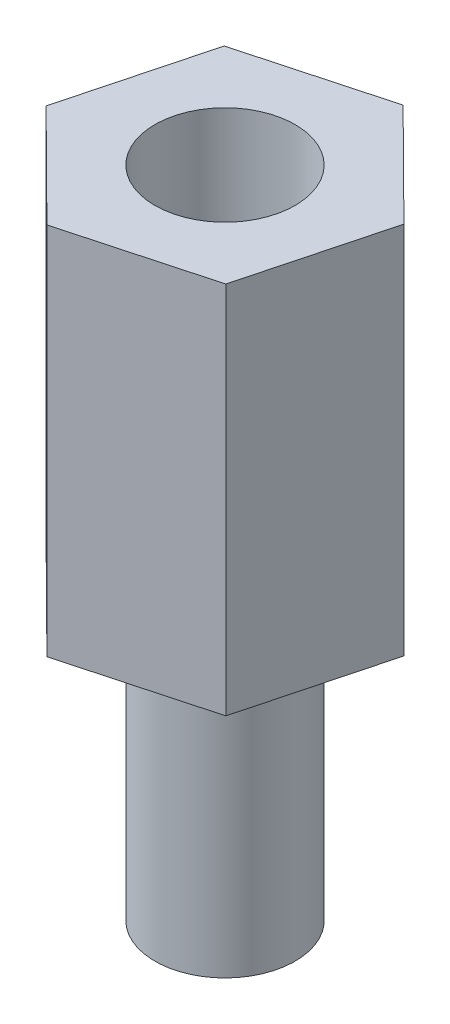
ISO-10303-21;
HEADER;
FILE_DESCRIPTION(('STEP AP214'),'2;1');
FILE_NAME('part.step','',(''),(''),'','','');
FILE_SCHEMA(('AUTOMOTIVE_DESIGN { 1 0 10303 214 1 1 1 1 }'));
ENDSEC;
DATA;
#1=APPLICATION_CONTEXT('core data for automotive mechanical design processes');
#2=APPLICATION_PROTOCOL_DEFINITION('international standard','automotive_design',2000,#1);
#3=PRODUCT_CONTEXT('',#1,'mechanical');
#4=PRODUCT('Part','Part','',(#3));
#5=PRODUCT_RELATED_PRODUCT_CATEGORY('part','',(#4));
#6=PRODUCT_DEFINITION_FORMATION('','',#4);
#7=PRODUCT_DEFINITION_CONTEXT('part definition',#1,'design');
#8=PRODUCT_DEFINITION('design','',#6,#7);
#9=PRODUCT_DEFINITION_SHAPE('','',#8);
#10=(LENGTH_UNIT() NAMED_UNIT(*) SI_UNIT(.MILLI.,.METRE.));
#11=(NAMED_UNIT(*) PLANE_ANGLE_UNIT() SI_UNIT($,.RADIAN.));
#12=(NAMED_UNIT(*) SI_UNIT($,.STERADIAN.) SOLID_ANGLE_UNIT());
#13=UNCERTAINTY_MEASURE_WITH_UNIT(LENGTH_MEASURE(1.E-05),#10,'distance_accuracy_value','');
#14=(GEOMETRIC_REPRESENTATION_CONTEXT(3) GLOBAL_UNCERTAINTY_ASSIGNED_CONTEXT((#13)) GLOBAL_UNIT_ASSIGNED_CONTEXT((#10,
#11,#12)) REPRESENTATION_CONTEXT('',''));
#15=CARTESIAN_POINT('',(0.,0.,0.));
#16=DIRECTION('',(0.,0.,1.));
#17=DIRECTION('',(1.,0.,0.));
#18=AXIS2_PLACEMENT_3D('',#15,#16,#17);
#19=CARTESIAN_POINT('',(-0.794817303643182,8.,3.01467501628772));
#20=DIRECTION('',(-0.262696146813826,0.,-0.964878611250746));
#21=DIRECTION('',(-0.964878611250746,0.,0.262696146813826));
#22=AXIS2_PLACEMENT_3D('',#19,#20,#21);
#23=PLANE('',#22);
#24=DIRECTION('',(0.964878611250746,0.,-0.262696146813826));
#25=VECTOR('',#24,1.);
#26=CARTESIAN_POINT('',(-0.794817303643182,0.,3.01467501628772));
#27=LINE('',#26,#25);
#28=CARTESIAN_POINT('',(-0.794817303643182,0.,3.01467501628772));
#29=VERTEX_POINT('',#28);
#30=CARTESIAN_POINT('',(2.21337649643784,0.,2.19566948446631));
#31=VERTEX_POINT('',#30);
#32=EDGE_CURVE('E130',#29,#31,#27,.T.);
#33=ORIENTED_EDGE('',*,*,#32,.T.);
#34=DIRECTION('',(0.,-1.,0.));
#35=VECTOR('',#34,1.);
#36=CARTESIAN_POINT('',(2.21337649643784,8.,2.19566948446631));
#37=LINE('',#36,#35);
#38=CARTESIAN_POINT('',(2.21337649643784,8.,2.19566948446631));
#39=VERTEX_POINT('',#38);
#40=EDGE_CURVE('E42',#39,#31,#37,.T.);
#41=ORIENTED_EDGE('',*,*,#40,.F.);
#42=DIRECTION('',(0.964878611250746,0.,-0.262696146813826));
#43=VECTOR('',#42,1.);
#44=CARTESIAN_POINT('',(-0.794817303643182,8.,3.01467501628772));
#45=LINE('',#44,#43);
#46=CARTESIAN_POINT('',(-0.794817303643182,8.,3.01467501628772));
#47=VERTEX_POINT('',#46);
#48=EDGE_CURVE('E147',#47,#39,#45,.T.);
#49=ORIENTED_EDGE('',*,*,#48,.F.);
#50=DIRECTION('',(0.,-1.,0.));
#51=VECTOR('',#50,1.);
#52=CARTESIAN_POINT('',(-0.794817303643182,8.,3.01467501628772));
#53=LINE('',#52,#51);
#54=EDGE_CURVE('E126',#47,#29,#53,.T.);
#55=ORIENTED_EDGE('',*,*,#54,.T.);
#56=EDGE_LOOP('',(#33,#41,#49,#55));
#57=FACE_BOUND('',#56,.T.);
#58=ADVANCED_FACE('F39',(#57),#23,.F.);
#59=CARTESIAN_POINT('',(2.21337649643784,8.,2.19566948446631));
#60=DIRECTION('',(-0.966957462318309,0.,-0.254937769008313));
#61=DIRECTION('',(-0.254937769008313,0.,0.966957462318309));
#62=AXIS2_PLACEMENT_3D('',#59,#60,#61);
#63=PLANE('',#62);
#64=DIRECTION('',(0.254937769008313,0.,-0.966957462318309));
#65=VECTOR('',#64,1.);
#66=CARTESIAN_POINT('',(2.21337649643784,0.,2.19566948446631));
#67=LINE('',#66,#65);
#68=CARTESIAN_POINT('',(3.00819380008103,0.,-0.819005531821416));
#69=VERTEX_POINT('',#68);
#70=EDGE_CURVE('E134',#31,#69,#67,.T.);
#71=ORIENTED_EDGE('',*,*,#70,.T.);
#72=DIRECTION('',(0.,-1.,0.));
#73=VECTOR('',#72,1.);
#74=CARTESIAN_POINT('',(3.00819380008103,8.,-0.819005531821416));
#75=LINE('',#74,#73);
#76=CARTESIAN_POINT('',(3.00819380008103,8.,-0.819005531821416));
#77=VERTEX_POINT('',#76);
#78=EDGE_CURVE('E153',#77,#69,#75,.T.);
#79=ORIENTED_EDGE('',*,*,#78,.F.);
#80=DIRECTION('',(0.254937769008313,0.,-0.966957462318309));
#81=VECTOR('',#80,1.);
#82=CARTESIAN_POINT('',(2.21337649643784,8.,2.19566948446631));
#83=LINE('',#82,#81);
#84=EDGE_CURVE('E95',#39,#77,#83,.T.);
#85=ORIENTED_EDGE('',*,*,#84,.F.);
#86=ORIENTED_EDGE('',*,*,#40,.T.);
#87=EDGE_LOOP('',(#71,#79,#85,#86));
#88=FACE_BOUND('',#87,.T.);
#89=ADVANCED_FACE('F160',(#88),#63,.F.);
#90=CARTESIAN_POINT('',(3.00819380008103,8.,-0.819005531821416));
#91=DIRECTION('',(-0.704261315504483,0.,0.709940842242433));
#92=DIRECTION('',(0.709940842242433,0.,0.704261315504483));
#93=AXIS2_PLACEMENT_3D('',#90,#91,#92);
#94=PLANE('',#93);
#95=DIRECTION('',(-0.709940842242433,0.,-0.704261315504483));
#96=VECTOR('',#95,1.);
#97=CARTESIAN_POINT('',(3.00819380008103,0.,-0.819005531821416));
#98=LINE('',#97,#96);
#99=CARTESIAN_POINT('',(0.794817303643183,0.,-3.01467501628772));
#100=VERTEX_POINT('',#99);
#101=EDGE_CURVE('E138',#69,#100,#98,.T.);
#102=ORIENTED_EDGE('',*,*,#101,.T.);
#103=DIRECTION('',(0.,-1.,0.));
#104=VECTOR('',#103,1.);
#105=CARTESIAN_POINT('',(0.794817303643183,8.,-3.01467501628772));
#106=LINE('',#105,#104);
#107=CARTESIAN_POINT('',(0.794817303643183,8.,-3.01467501628772));
#108=VERTEX_POINT('',#107);
#109=EDGE_CURVE('E119',#108,#100,#106,.T.);
#110=ORIENTED_EDGE('',*,*,#109,.F.);
#111=DIRECTION('',(-0.709940842242433,0.,-0.704261315504483));
#112=VECTOR('',#111,1.);
#113=CARTESIAN_POINT('',(3.00819380008103,8.,-0.819005531821416));
#114=LINE('',#113,#112);
#115=EDGE_CURVE('E108',#77,#108,#114,.T.);
#116=ORIENTED_EDGE('',*,*,#115,.F.);
#117=ORIENTED_EDGE('',*,*,#78,.T.);
#118=EDGE_LOOP('',(#102,#110,#116,#117));
#119=FACE_BOUND('',#118,.T.);
#120=ADVANCED_FACE('F166',(#119),#94,.F.);
#121=CARTESIAN_POINT('',(0.794817303643183,8.,-3.01467501628772));
#122=DIRECTION('',(0.262696146813826,0.,0.964878611250746));
#123=DIRECTION('',(0.964878611250746,0.,-0.262696146813826));
#124=AXIS2_PLACEMENT_3D('',#121,#122,#123);
#125=PLANE('',#124);
#126=DIRECTION('',(-0.964878611250746,0.,0.262696146813826));
#127=VECTOR('',#126,1.);
#128=CARTESIAN_POINT('',(0.794817303643183,0.,-3.01467501628772));
#129=LINE('',#128,#127);
#130=CARTESIAN_POINT('',(-2.21337649643784,0.,-2.19566948446631));
#131=VERTEX_POINT('',#130);
#132=EDGE_CURVE('E117',#100,#131,#129,.T.);
#133=ORIENTED_EDGE('',*,*,#132,.T.);
#134=DIRECTION('',(0.,-1.,0.));
#135=VECTOR('',#134,1.);
#136=CARTESIAN_POINT('',(-2.21337649643784,8.,-2.19566948446631));
#137=LINE('',#136,#135);
#138=CARTESIAN_POINT('',(-2.21337649643784,8.,-2.19566948446631));
#139=VERTEX_POINT('',#138);
#140=EDGE_CURVE('E114',#139,#131,#137,.T.);
#141=ORIENTED_EDGE('',*,*,#140,.F.);
#142=DIRECTION('',(-0.964878611250746,0.,0.262696146813826));
#143=VECTOR('',#142,1.);
#144=CARTESIAN_POINT('',(0.794817303643183,8.,-3.01467501628772));
#145=LINE('',#144,#143);
#146=EDGE_CURVE('E102',#108,#139,#145,.T.);
#147=ORIENTED_EDGE('',*,*,#146,.F.);
#148=ORIENTED_EDGE('',*,*,#109,.T.);
#149=EDGE_LOOP('',(#133,#141,#147,#148));
#150=FACE_BOUND('',#149,.T.);
#151=ADVANCED_FACE('F115',(#150),#125,.F.);
#152=CARTESIAN_POINT('',(-2.21337649643784,8.,-2.19566948446631));
#153=DIRECTION('',(0.966957462318309,0.,0.254937769008313));
#154=DIRECTION('',(0.254937769008313,0.,-0.966957462318309));
#155=AXIS2_PLACEMENT_3D('',#152,#153,#154);
#156=PLANE('',#155);
#157=DIRECTION('',(-0.254937769008313,0.,0.966957462318309));
#158=VECTOR('',#157,1.);
#159=CARTESIAN_POINT('',(-2.21337649643784,0.,-2.19566948446631));
#160=LINE('',#159,#158);
#161=CARTESIAN_POINT('',(-3.00819380008103,0.,0.819005531821416));
#162=VERTEX_POINT('',#161);
#163=EDGE_CURVE('E80',#131,#162,#160,.T.);
#164=ORIENTED_EDGE('',*,*,#163,.T.);
#165=DIRECTION('',(0.,-1.,0.));
#166=VECTOR('',#165,1.);
#167=CARTESIAN_POINT('',(-3.00819380008103,8.,0.819005531821416));
#168=LINE('',#167,#166);
#169=CARTESIAN_POINT('',(-3.00819380008103,8.,0.819005531821416));
#170=VERTEX_POINT('',#169);
#171=EDGE_CURVE('E120',#170,#162,#168,.T.);
#172=ORIENTED_EDGE('',*,*,#171,.F.);
#173=DIRECTION('',(-0.254937769008313,0.,0.966957462318309));
#174=VECTOR('',#173,1.);
#175=CARTESIAN_POINT('',(-2.21337649643784,8.,-2.19566948446631));
#176=LINE('',#175,#174);
#177=EDGE_CURVE('E106',#139,#170,#176,.T.);
#178=ORIENTED_EDGE('',*,*,#177,.F.);
#179=ORIENTED_EDGE('',*,*,#140,.T.);
#180=EDGE_LOOP('',(#164,#172,#178,#179));
#181=FACE_BOUND('',#180,.T.);
#182=ADVANCED_FACE('F122',(#181),#156,.F.);
#183=CARTESIAN_POINT('',(-3.00819380008103,8.,0.819005531821416));
#184=DIRECTION('',(0.704261315504483,0.,-0.709940842242433));
#185=DIRECTION('',(-0.709940842242433,0.,-0.704261315504483));
#186=AXIS2_PLACEMENT_3D('',#183,#184,#185);
#187=PLANE('',#186);
#188=DIRECTION('',(0.709940842242433,0.,0.704261315504483));
#189=VECTOR('',#188,1.);
#190=CARTESIAN_POINT('',(-3.00819380008103,0.,0.819005531821416));
#191=LINE('',#190,#189);
#192=EDGE_CURVE('E86',#162,#29,#191,.T.);
#193=ORIENTED_EDGE('',*,*,#192,.T.);
#194=ORIENTED_EDGE('',*,*,#54,.F.);
#195=DIRECTION('',(0.709940842242433,0.,0.704261315504483));
#196=VECTOR('',#195,1.);
#197=CARTESIAN_POINT('',(-3.00819380008103,8.,0.819005531821416));
#198=LINE('',#197,#196);
#199=EDGE_CURVE('E57',#170,#47,#198,.T.);
#200=ORIENTED_EDGE('',*,*,#199,.F.);
#201=ORIENTED_EDGE('',*,*,#171,.T.);
#202=EDGE_LOOP('',(#193,#194,#200,#201));
#203=FACE_BOUND('',#202,.T.);
#204=ADVANCED_FACE('F203',(#203),#187,.F.);
#205=CARTESIAN_POINT('',(0.,8.,0.));
#206=DIRECTION('',(0.,1.,0.));
#207=DIRECTION('',(0.,0.,1.));
#208=AXIS2_PLACEMENT_3D('',#205,#206,#207);
#209=PLANE('',#208);
#210=CARTESIAN_POINT('',(0.,8.,0.));
#211=DIRECTION('',(0.,1.,0.));
#212=DIRECTION('',(0.,0.,1.));
#213=AXIS2_PLACEMENT_3D('',#210,#211,#212);
#214=CIRCLE('',#213,1.5);
#215=CARTESIAN_POINT('',(0.,8.,1.5));
#216=VERTEX_POINT('',#215);
#217=EDGE_CURVE('E173',#216,#216,#214,.T.);
#218=ORIENTED_EDGE('',*,*,#217,.F.);
#219=EDGE_LOOP('',(#218));
#220=FACE_BOUND('',#219,.T.);
#221=ORIENTED_EDGE('',*,*,#48,.T.);
#222=ORIENTED_EDGE('',*,*,#84,.T.);
#223=ORIENTED_EDGE('',*,*,#115,.T.);
#224=ORIENTED_EDGE('',*,*,#146,.T.);
#225=ORIENTED_EDGE('',*,*,#177,.T.);
#226=ORIENTED_EDGE('',*,*,#199,.T.);
#227=EDGE_LOOP('',(#221,#222,#223,#224,#225,#226));
#228=FACE_BOUND('',#227,.T.);
#229=ADVANCED_FACE('F104',(#220,#228),#209,.T.);
#230=CARTESIAN_POINT('',(0.,0.,0.));
#231=DIRECTION('',(0.,1.,0.));
#232=DIRECTION('',(0.,0.,1.));
#233=AXIS2_PLACEMENT_3D('',#230,#231,#232);
#234=PLANE('',#233);
#235=CARTESIAN_POINT('',(0.,0.,0.));
#236=DIRECTION('',(0.,-1.,0.));
#237=DIRECTION('',(0.,0.,-1.));
#238=AXIS2_PLACEMENT_3D('',#235,#236,#237);
#239=CIRCLE('',#238,1.5);
#240=CARTESIAN_POINT('',(0.,0.,-1.5));
#241=VERTEX_POINT('',#240);
#242=EDGE_CURVE('E11',#241,#241,#239,.T.);
#243=ORIENTED_EDGE('',*,*,#242,.F.);
#244=EDGE_LOOP('',(#243));
#245=FACE_BOUND('',#244,.T.);
#246=ORIENTED_EDGE('',*,*,#32,.F.);
#247=ORIENTED_EDGE('',*,*,#192,.F.);
#248=ORIENTED_EDGE('',*,*,#163,.F.);
#249=ORIENTED_EDGE('',*,*,#132,.F.);
#250=ORIENTED_EDGE('',*,*,#101,.F.);
#251=ORIENTED_EDGE('',*,*,#70,.F.);
#252=EDGE_LOOP('',(#246,#247,#248,#249,#250,#251));
#253=FACE_BOUND('',#252,.T.);
#254=ADVANCED_FACE('F165',(#245,#253),#234,.F.);
#255=CARTESIAN_POINT('',(0.,2.,0.));
#256=DIRECTION('',(0.,1.,0.));
#257=DIRECTION('',(0.,0.,1.));
#258=AXIS2_PLACEMENT_3D('',#255,#256,#257);
#259=CYLINDRICAL_SURFACE('',#258,1.5);
#260=CARTESIAN_POINT('',(0.,2.,0.));
#261=DIRECTION('',(0.,1.,0.));
#262=DIRECTION('',(0.,0.,1.));
#263=AXIS2_PLACEMENT_3D('',#260,#261,#262);
#264=CIRCLE('',#263,1.5);
#265=CARTESIAN_POINT('',(0.,2.,1.5));
#266=VERTEX_POINT('',#265);
#267=EDGE_CURVE('E135',#266,#266,#264,.T.);
#268=ORIENTED_EDGE('',*,*,#267,.F.);
#269=EDGE_LOOP('',(#268));
#270=FACE_BOUND('',#269,.T.);
#271=ORIENTED_EDGE('',*,*,#217,.T.);
#272=EDGE_LOOP('',(#271));
#273=FACE_BOUND('',#272,.T.);
#274=ADVANCED_FACE('F195',(#270,#273),#259,.F.);
#275=CARTESIAN_POINT('',(0.,2.,0.));
#276=DIRECTION('',(0.,1.,0.));
#277=DIRECTION('',(0.,0.,1.));
#278=AXIS2_PLACEMENT_3D('',#275,#276,#277);
#279=PLANE('',#278);
#280=ORIENTED_EDGE('',*,*,#267,.T.);
#281=EDGE_LOOP('',(#280));
#282=FACE_BOUND('',#281,.T.);
#283=ADVANCED_FACE('F190',(#282),#279,.T.);
#284=CARTESIAN_POINT('',(0.,-6.,0.));
#285=DIRECTION('',(0.,1.,0.));
#286=DIRECTION('',(0.,0.,1.));
#287=AXIS2_PLACEMENT_3D('',#284,#285,#286);
#288=CYLINDRICAL_SURFACE('',#287,1.5);
#289=CARTESIAN_POINT('',(0.,-6.,0.));
#290=DIRECTION('',(0.,-1.,0.));
#291=DIRECTION('',(0.,0.,-1.));
#292=AXIS2_PLACEMENT_3D('',#289,#290,#291);
#293=CIRCLE('',#292,1.5);
#294=CARTESIAN_POINT('',(0.,-6.,-1.5));
#295=VERTEX_POINT('',#294);
#296=EDGE_CURVE('E177',#295,#295,#293,.T.);
#297=ORIENTED_EDGE('',*,*,#296,.F.);
#298=EDGE_LOOP('',(#297));
#299=FACE_BOUND('',#298,.T.);
#300=ORIENTED_EDGE('',*,*,#242,.T.);
#301=EDGE_LOOP('',(#300));
#302=FACE_BOUND('',#301,.T.);
#303=ADVANCED_FACE('F187',(#299,#302),#288,.T.);
#304=CARTESIAN_POINT('',(0.,-6.,0.));
#305=DIRECTION('',(0.,-1.,0.));
#306=DIRECTION('',(0.,0.,-1.));
#307=AXIS2_PLACEMENT_3D('',#304,#305,#306);
#308=PLANE('',#307);
#309=ORIENTED_EDGE('',*,*,#296,.T.);
#310=EDGE_LOOP('',(#309));
#311=FACE_BOUND('',#310,.T.);
#312=ADVANCED_FACE('F185',(#311),#308,.T.);
#313=CLOSED_SHELL('',(#58,#89,#120,#151,#182,#204,#229,#254,#274,#283,#303,#312));
#314=MANIFOLD_SOLID_BREP('B2',#313);
#315=ADVANCED_BREP_SHAPE_REPRESENTATION('',(#18,#314),#14);
#316=SHAPE_DEFINITION_REPRESENTATION(#9,#315);
ENDSEC;
END-ISO-10303-21;
